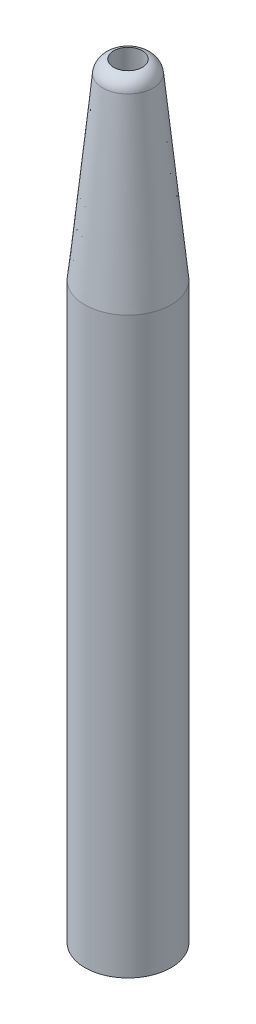
ISO-10303-21;
HEADER;
FILE_DESCRIPTION(('STEP AP214'),'2;1');
FILE_NAME('part.step','',(''),(''),'','','');
FILE_SCHEMA(('AUTOMOTIVE_DESIGN { 1 0 10303 214 1 1 1 1 }'));
ENDSEC;
DATA;
#1=APPLICATION_CONTEXT('core data for automotive mechanical design processes');
#2=APPLICATION_PROTOCOL_DEFINITION('international standard','automotive_design',2000,#1);
#3=PRODUCT_CONTEXT('',#1,'mechanical');
#4=PRODUCT('Part','Part','',(#3));
#5=PRODUCT_RELATED_PRODUCT_CATEGORY('part','',(#4));
#6=PRODUCT_DEFINITION_FORMATION('','',#4);
#7=PRODUCT_DEFINITION_CONTEXT('part definition',#1,'design');
#8=PRODUCT_DEFINITION('design','',#6,#7);
#9=PRODUCT_DEFINITION_SHAPE('','',#8);
#10=(LENGTH_UNIT() NAMED_UNIT(*) SI_UNIT(.MILLI.,.METRE.));
#11=(NAMED_UNIT(*) PLANE_ANGLE_UNIT() SI_UNIT($,.RADIAN.));
#12=(NAMED_UNIT(*) SI_UNIT($,.STERADIAN.) SOLID_ANGLE_UNIT());
#13=UNCERTAINTY_MEASURE_WITH_UNIT(LENGTH_MEASURE(1.E-05),#10,'distance_accuracy_value','');
#14=(GEOMETRIC_REPRESENTATION_CONTEXT(3) GLOBAL_UNCERTAINTY_ASSIGNED_CONTEXT((#13)) GLOBAL_UNIT_ASSIGNED_CONTEXT((#10,
#11,#12)) REPRESENTATION_CONTEXT('',''));
#15=CARTESIAN_POINT('',(0.,0.,0.));
#16=DIRECTION('',(0.,0.,1.));
#17=DIRECTION('',(1.,0.,0.));
#18=AXIS2_PLACEMENT_3D('',#15,#16,#17);
#19=CARTESIAN_POINT('',(0.,120.,0.));
#20=DIRECTION('',(0.,-1.,0.));
#21=DIRECTION('',(0.,0.,-1.));
#22=AXIS2_PLACEMENT_3D('',#19,#20,#21);
#23=CYLINDRICAL_SURFACE('',#22,9.);
#24=CARTESIAN_POINT('',(0.,120.,0.));
#25=DIRECTION('',(0.,1.,0.));
#26=DIRECTION('',(0.,0.,1.));
#27=AXIS2_PLACEMENT_3D('',#24,#25,#26);
#28=CIRCLE('',#27,9.);
#29=CARTESIAN_POINT('',(0.,120.,9.));
#30=VERTEX_POINT('',#29);
#31=EDGE_CURVE('E45',#30,#30,#28,.T.);
#32=ORIENTED_EDGE('',*,*,#31,.F.);
#33=EDGE_LOOP('',(#32));
#34=FACE_BOUND('',#33,.T.);
#35=CARTESIAN_POINT('',(0.,0.,0.));
#36=DIRECTION('',(0.,1.,0.));
#37=DIRECTION('',(0.,0.,1.));
#38=AXIS2_PLACEMENT_3D('',#35,#36,#37);
#39=CIRCLE('',#38,9.);
#40=CARTESIAN_POINT('',(0.,0.,9.));
#41=VERTEX_POINT('',#40);
#42=EDGE_CURVE('E49',#41,#41,#39,.T.);
#43=ORIENTED_EDGE('',*,*,#42,.T.);
#44=EDGE_LOOP('',(#43));
#45=FACE_BOUND('',#44,.T.);
#46=ADVANCED_FACE('F34',(#34,#45),#23,.T.);
#47=CARTESIAN_POINT('',(0.,120.,0.));
#48=DIRECTION('',(0.,-1.,0.));
#49=DIRECTION('',(0.,0.,-1.));
#50=AXIS2_PLACEMENT_3D('',#47,#48,#49);
#51=CYLINDRICAL_SURFACE('',#50,7.);
#52=CARTESIAN_POINT('',(0.,4.47213595499958,0.));
#53=DIRECTION('',(0.,-1.,0.));
#54=DIRECTION('',(0.,0.,-1.));
#55=AXIS2_PLACEMENT_3D('',#52,#53,#54);
#56=CIRCLE('',#55,7.);
#57=CARTESIAN_POINT('',(0.,4.47213595499958,-7.));
#58=VERTEX_POINT('',#57);
#59=EDGE_CURVE('E10',#58,#58,#56,.T.);
#60=ORIENTED_EDGE('',*,*,#59,.T.);
#61=EDGE_LOOP('',(#60));
#62=FACE_BOUND('',#61,.T.);
#63=CARTESIAN_POINT('',(0.,120.,0.));
#64=DIRECTION('',(0.,-1.,0.));
#65=DIRECTION('',(0.,0.,-1.));
#66=AXIS2_PLACEMENT_3D('',#63,#64,#65);
#67=CIRCLE('',#66,7.);
#68=CARTESIAN_POINT('',(0.,120.,-7.));
#69=VERTEX_POINT('',#68);
#70=EDGE_CURVE('E53',#69,#69,#67,.T.);
#71=ORIENTED_EDGE('',*,*,#70,.F.);
#72=EDGE_LOOP('',(#71));
#73=FACE_BOUND('',#72,.T.);
#74=ADVANCED_FACE('F73',(#62,#73),#51,.F.);
#75=CARTESIAN_POINT('',(0.,120.,0.));
#76=DIRECTION('',(0.,-1.,0.));
#77=DIRECTION('',(0.,0.,-1.));
#78=AXIS2_PLACEMENT_3D('',#75,#76,#77);
#79=CONICAL_SURFACE('',#78,9.,0.0996686524911621);
#80=CARTESIAN_POINT('',(0.,157.387140963526,0.));
#81=DIRECTION('',(0.,-1.,0.));
#82=DIRECTION('',(0.,0.,-1.));
#83=AXIS2_PLACEMENT_3D('',#80,#81,#82);
#84=CIRCLE('',#83,5.26128590364743);
#85=CARTESIAN_POINT('',(0.,157.387140963526,-5.26128590364743));
#86=VERTEX_POINT('',#85);
#87=EDGE_CURVE('E41',#86,#86,#84,.T.);
#88=ORIENTED_EDGE('',*,*,#87,.T.);
#89=EDGE_LOOP('',(#88));
#90=FACE_BOUND('',#89,.T.);
#91=ORIENTED_EDGE('',*,*,#31,.T.);
#92=EDGE_LOOP('',(#91));
#93=FACE_BOUND('',#92,.T.);
#94=ADVANCED_FACE('F66',(#90,#93),#79,.T.);
#95=CARTESIAN_POINT('',(0.,160.,0.));
#96=DIRECTION('',(0.,-1.,0.));
#97=DIRECTION('',(0.,0.,-1.));
#98=AXIS2_PLACEMENT_3D('',#95,#96,#97);
#99=CONICAL_SURFACE('',#98,3.,0.099668652491162);
#100=ORIENTED_EDGE('',*,*,#70,.T.);
#101=EDGE_LOOP('',(#100));
#102=FACE_BOUND('',#101,.T.);
#103=CARTESIAN_POINT('',(0.,160.,0.));
#104=DIRECTION('',(0.,-1.,0.));
#105=DIRECTION('',(0.,0.,-1.));
#106=AXIS2_PLACEMENT_3D('',#103,#104,#105);
#107=CIRCLE('',#106,3.);
#108=CARTESIAN_POINT('',(0.,160.,-3.));
#109=VERTEX_POINT('',#108);
#110=EDGE_CURVE('E57',#109,#109,#107,.T.);
#111=ORIENTED_EDGE('',*,*,#110,.F.);
#112=EDGE_LOOP('',(#111));
#113=FACE_BOUND('',#112,.T.);
#114=ADVANCED_FACE('F64',(#102,#113),#99,.F.);
#115=CARTESIAN_POINT('',(0.,157.088629806463,0.));
#116=DIRECTION('',(0.,1.,0.));
#117=DIRECTION('',(0.,0.,1.));
#118=AXIS2_PLACEMENT_3D('',#115,#116,#117);
#119=DEGENERATE_TOROIDAL_SURFACE('',#118,2.27617433301746,3.,.T.);
#120=ORIENTED_EDGE('',*,*,#110,.T.);
#121=EDGE_LOOP('',(#120));
#122=FACE_BOUND('',#121,.T.);
#123=ORIENTED_EDGE('',*,*,#87,.F.);
#124=EDGE_LOOP('',(#123));
#125=FACE_BOUND('',#124,.T.);
#126=ADVANCED_FACE('F61',(#122,#125),#119,.T.);
#127=CARTESIAN_POINT('',(0.,4.47213595499958,0.));
#128=DIRECTION('',(0.,-1.,0.));
#129=DIRECTION('',(0.,0.,-1.));
#130=AXIS2_PLACEMENT_3D('',#127,#128,#129);
#131=TOROIDAL_SURFACE('',#130,13.,6.);
#132=ORIENTED_EDGE('',*,*,#42,.F.);
#133=EDGE_LOOP('',(#132));
#134=FACE_BOUND('',#133,.T.);
#135=ORIENTED_EDGE('',*,*,#59,.F.);
#136=EDGE_LOOP('',(#135));
#137=FACE_BOUND('',#136,.T.);
#138=ADVANCED_FACE('F36',(#134,#137),#131,.T.);
#139=CLOSED_SHELL('',(#46,#74,#94,#114,#126,#138));
#140=MANIFOLD_SOLID_BREP('B2',#139);
#141=ADVANCED_BREP_SHAPE_REPRESENTATION('',(#18,#140),#14);
#142=SHAPE_DEFINITION_REPRESENTATION(#9,#141);
ENDSEC;
END-ISO-10303-21;
